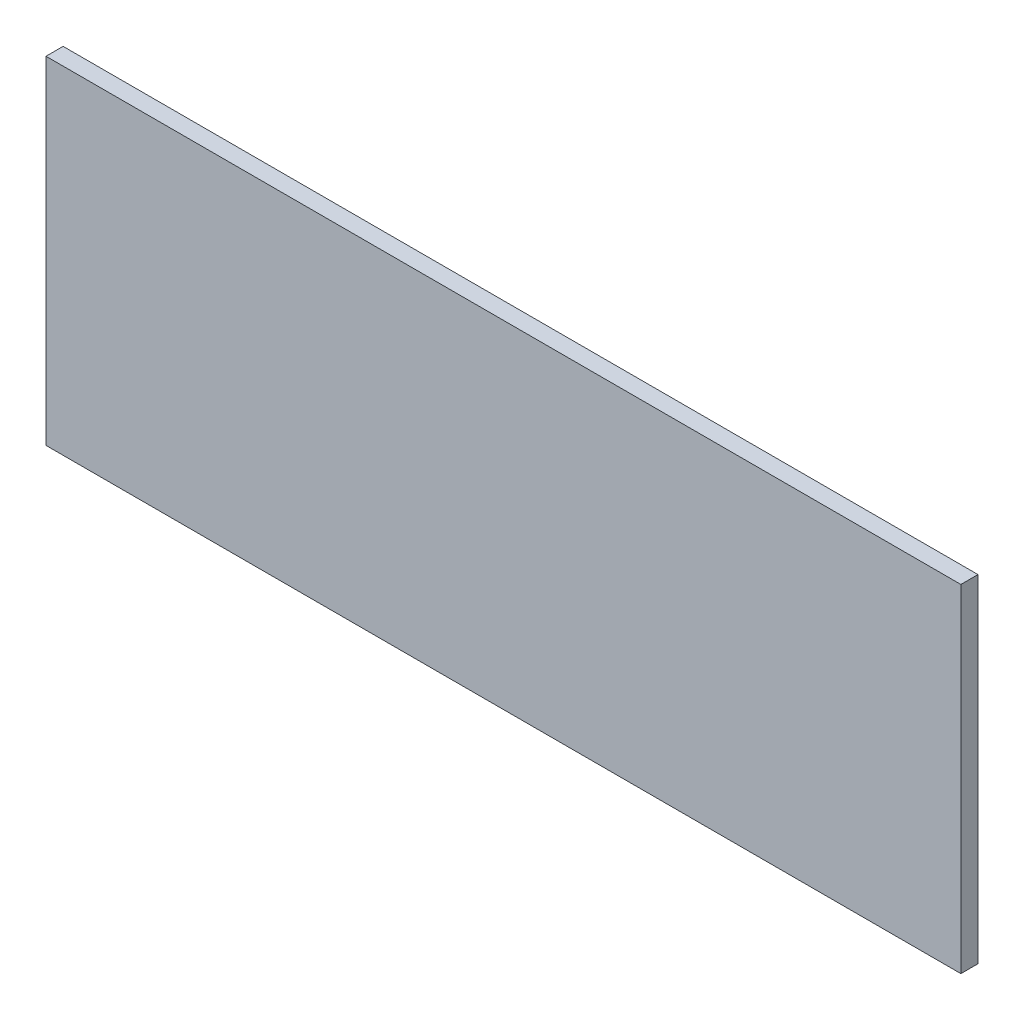
ISO-10303-21;
HEADER;
FILE_DESCRIPTION(('STEP AP214'),'2;1');
FILE_NAME('part.step','',(''),(''),'','','');
FILE_SCHEMA(('AUTOMOTIVE_DESIGN { 1 0 10303 214 1 1 1 1 }'));
ENDSEC;
DATA;
#1=APPLICATION_CONTEXT('core data for automotive mechanical design processes');
#2=APPLICATION_PROTOCOL_DEFINITION('international standard','automotive_design',2000,#1);
#3=PRODUCT_CONTEXT('',#1,'mechanical');
#4=PRODUCT('Part','Part','',(#3));
#5=PRODUCT_RELATED_PRODUCT_CATEGORY('part','',(#4));
#6=PRODUCT_DEFINITION_FORMATION('','',#4);
#7=PRODUCT_DEFINITION_CONTEXT('part definition',#1,'design');
#8=PRODUCT_DEFINITION('design','',#6,#7);
#9=PRODUCT_DEFINITION_SHAPE('','',#8);
#10=(LENGTH_UNIT() NAMED_UNIT(*) SI_UNIT(.MILLI.,.METRE.));
#11=(NAMED_UNIT(*) PLANE_ANGLE_UNIT() SI_UNIT($,.RADIAN.));
#12=(NAMED_UNIT(*) SI_UNIT($,.STERADIAN.) SOLID_ANGLE_UNIT());
#13=UNCERTAINTY_MEASURE_WITH_UNIT(LENGTH_MEASURE(1.E-05),#10,'distance_accuracy_value','');
#14=(GEOMETRIC_REPRESENTATION_CONTEXT(3) GLOBAL_UNCERTAINTY_ASSIGNED_CONTEXT((#13)) GLOBAL_UNIT_ASSIGNED_CONTEXT((#10,
#11,#12)) REPRESENTATION_CONTEXT('',''));
#15=CARTESIAN_POINT('',(0.,0.,0.));
#16=DIRECTION('',(0.,0.,1.));
#17=DIRECTION('',(1.,0.,0.));
#18=AXIS2_PLACEMENT_3D('',#15,#16,#17);
#19=CARTESIAN_POINT('',(81.8669967651367,57.5870018005371,0.));
#20=DIRECTION('',(0.,1.,0.));
#21=DIRECTION('',(1.,0.,0.));
#22=AXIS2_PLACEMENT_3D('',#19,#20,#21);
#23=PLANE('',#22);
#24=DIRECTION('',(1.,0.,0.));
#25=VECTOR('',#24,1.);
#26=CARTESIAN_POINT('',(81.8669967651367,57.5870018005371,0.03556));
#27=LINE('',#26,#25);
#28=CARTESIAN_POINT('',(81.8669967651367,57.5870018005371,0.03556));
#29=VERTEX_POINT('',#28);
#30=CARTESIAN_POINT('',(83.7669982910156,57.5870018005371,0.03556));
#31=VERTEX_POINT('',#30);
#32=EDGE_CURVE('E11',#29,#31,#27,.T.);
#33=ORIENTED_EDGE('',*,*,#32,.F.);
#34=DIRECTION('',(0.,0.,1.));
#35=VECTOR('',#34,1.);
#36=CARTESIAN_POINT('',(81.8669967651367,57.5870018005371,0.));
#37=LINE('',#36,#35);
#38=CARTESIAN_POINT('',(81.8669967651367,57.5870018005371,0.));
#39=VERTEX_POINT('',#38);
#40=EDGE_CURVE('E24',#39,#29,#37,.T.);
#41=ORIENTED_EDGE('',*,*,#40,.F.);
#42=DIRECTION('',(1.,0.,0.));
#43=VECTOR('',#42,1.);
#44=CARTESIAN_POINT('',(81.8669967651367,57.5870018005371,0.));
#45=LINE('',#44,#43);
#46=CARTESIAN_POINT('',(83.7669982910156,57.5870018005371,0.));
#47=VERTEX_POINT('',#46);
#48=EDGE_CURVE('E75',#39,#47,#45,.T.);
#49=ORIENTED_EDGE('',*,*,#48,.T.);
#50=DIRECTION('',(0.,0.,1.));
#51=VECTOR('',#50,1.);
#52=CARTESIAN_POINT('',(83.7669982910156,57.5870018005371,0.));
#53=LINE('',#52,#51);
#54=EDGE_CURVE('E37',#47,#31,#53,.T.);
#55=ORIENTED_EDGE('',*,*,#54,.T.);
#56=EDGE_LOOP('',(#33,#41,#49,#55));
#57=FACE_BOUND('',#56,.T.);
#58=ADVANCED_FACE('F17',(#57),#23,.F.);
#59=CARTESIAN_POINT('',(83.7669982910156,57.5870018005371,0.));
#60=DIRECTION('',(-1.,0.,0.));
#61=DIRECTION('',(0.,1.,0.));
#62=AXIS2_PLACEMENT_3D('',#59,#60,#61);
#63=PLANE('',#62);
#64=DIRECTION('',(0.,1.,0.));
#65=VECTOR('',#64,1.);
#66=CARTESIAN_POINT('',(83.7669982910156,57.5870018005371,0.03556));
#67=LINE('',#66,#65);
#68=CARTESIAN_POINT('',(83.7669982910156,58.2869987487793,0.03556));
#69=VERTEX_POINT('',#68);
#70=EDGE_CURVE('E83',#31,#69,#67,.T.);
#71=ORIENTED_EDGE('',*,*,#70,.F.);
#72=ORIENTED_EDGE('',*,*,#54,.F.);
#73=DIRECTION('',(0.,1.,0.));
#74=VECTOR('',#73,1.);
#75=CARTESIAN_POINT('',(83.7669982910156,57.5870018005371,0.));
#76=LINE('',#75,#74);
#77=CARTESIAN_POINT('',(83.7669982910156,58.2869987487793,0.));
#78=VERTEX_POINT('',#77);
#79=EDGE_CURVE('E81',#47,#78,#76,.T.);
#80=ORIENTED_EDGE('',*,*,#79,.T.);
#81=DIRECTION('',(0.,0.,1.));
#82=VECTOR('',#81,1.);
#83=CARTESIAN_POINT('',(83.7669982910156,58.2869987487793,0.));
#84=LINE('',#83,#82);
#85=EDGE_CURVE('E67',#78,#69,#84,.T.);
#86=ORIENTED_EDGE('',*,*,#85,.T.);
#87=EDGE_LOOP('',(#71,#72,#80,#86));
#88=FACE_BOUND('',#87,.T.);
#89=ADVANCED_FACE('F89',(#88),#63,.F.);
#90=CARTESIAN_POINT('',(83.7669982910156,58.2869987487793,0.));
#91=DIRECTION('',(0.,-1.,0.));
#92=DIRECTION('',(-1.,0.,0.));
#93=AXIS2_PLACEMENT_3D('',#90,#91,#92);
#94=PLANE('',#93);
#95=DIRECTION('',(-1.,0.,0.));
#96=VECTOR('',#95,1.);
#97=CARTESIAN_POINT('',(83.7669982910156,58.2869987487793,0.03556));
#98=LINE('',#97,#96);
#99=CARTESIAN_POINT('',(81.8669967651367,58.2869987487793,0.03556));
#100=VERTEX_POINT('',#99);
#101=EDGE_CURVE('E71',#69,#100,#98,.T.);
#102=ORIENTED_EDGE('',*,*,#101,.F.);
#103=ORIENTED_EDGE('',*,*,#85,.F.);
#104=DIRECTION('',(-1.,0.,0.));
#105=VECTOR('',#104,1.);
#106=CARTESIAN_POINT('',(83.7669982910156,58.2869987487793,0.));
#107=LINE('',#106,#105);
#108=CARTESIAN_POINT('',(81.8669967651367,58.2869987487793,0.));
#109=VERTEX_POINT('',#108);
#110=EDGE_CURVE('E63',#78,#109,#107,.T.);
#111=ORIENTED_EDGE('',*,*,#110,.T.);
#112=DIRECTION('',(0.,0.,1.));
#113=VECTOR('',#112,1.);
#114=CARTESIAN_POINT('',(81.8669967651367,58.2869987487793,0.));
#115=LINE('',#114,#113);
#116=EDGE_CURVE('E53',#109,#100,#115,.T.);
#117=ORIENTED_EDGE('',*,*,#116,.T.);
#118=EDGE_LOOP('',(#102,#103,#111,#117));
#119=FACE_BOUND('',#118,.T.);
#120=ADVANCED_FACE('F66',(#119),#94,.F.);
#121=CARTESIAN_POINT('',(81.8669967651367,58.2869987487793,0.));
#122=DIRECTION('',(1.,0.,0.));
#123=DIRECTION('',(0.,-1.,0.));
#124=AXIS2_PLACEMENT_3D('',#121,#122,#123);
#125=PLANE('',#124);
#126=DIRECTION('',(0.,-1.,0.));
#127=VECTOR('',#126,1.);
#128=CARTESIAN_POINT('',(81.8669967651367,58.2869987487793,0.03556));
#129=LINE('',#128,#127);
#130=EDGE_CURVE('E59',#100,#29,#129,.T.);
#131=ORIENTED_EDGE('',*,*,#130,.F.);
#132=ORIENTED_EDGE('',*,*,#116,.F.);
#133=DIRECTION('',(0.,-1.,0.));
#134=VECTOR('',#133,1.);
#135=CARTESIAN_POINT('',(81.8669967651367,58.2869987487793,0.));
#136=LINE('',#135,#134);
#137=EDGE_CURVE('E57',#109,#39,#136,.T.);
#138=ORIENTED_EDGE('',*,*,#137,.T.);
#139=ORIENTED_EDGE('',*,*,#40,.T.);
#140=EDGE_LOOP('',(#131,#132,#138,#139));
#141=FACE_BOUND('',#140,.T.);
#142=ADVANCED_FACE('F55',(#141),#125,.F.);
#143=CARTESIAN_POINT('',(81.8669967651367,57.5870018005371,0.));
#144=DIRECTION('',(0.,0.,-1.));
#145=DIRECTION('',(-1.,0.,0.));
#146=AXIS2_PLACEMENT_3D('',#143,#144,#145);
#147=PLANE('',#146);
#148=ORIENTED_EDGE('',*,*,#137,.F.);
#149=ORIENTED_EDGE('',*,*,#110,.F.);
#150=ORIENTED_EDGE('',*,*,#79,.F.);
#151=ORIENTED_EDGE('',*,*,#48,.F.);
#152=EDGE_LOOP('',(#148,#149,#150,#151));
#153=FACE_BOUND('',#152,.T.);
#154=ADVANCED_FACE('F74',(#153),#147,.T.);
#155=CARTESIAN_POINT('',(81.8669967651367,57.5870018005371,0.03556));
#156=DIRECTION('',(0.,0.,-1.));
#157=DIRECTION('',(-1.,0.,0.));
#158=AXIS2_PLACEMENT_3D('',#155,#156,#157);
#159=PLANE('',#158);
#160=ORIENTED_EDGE('',*,*,#32,.T.);
#161=ORIENTED_EDGE('',*,*,#70,.T.);
#162=ORIENTED_EDGE('',*,*,#101,.T.);
#163=ORIENTED_EDGE('',*,*,#130,.T.);
#164=EDGE_LOOP('',(#160,#161,#162,#163));
#165=FACE_BOUND('',#164,.T.);
#166=ADVANCED_FACE('F91',(#165),#159,.F.);
#167=CLOSED_SHELL('',(#58,#89,#120,#142,#154,#166));
#168=MANIFOLD_SOLID_BREP('B1',#167);
#169=ADVANCED_BREP_SHAPE_REPRESENTATION('',(#18,#168),#14);
#170=SHAPE_DEFINITION_REPRESENTATION(#9,#169);
ENDSEC;
END-ISO-10303-21;
